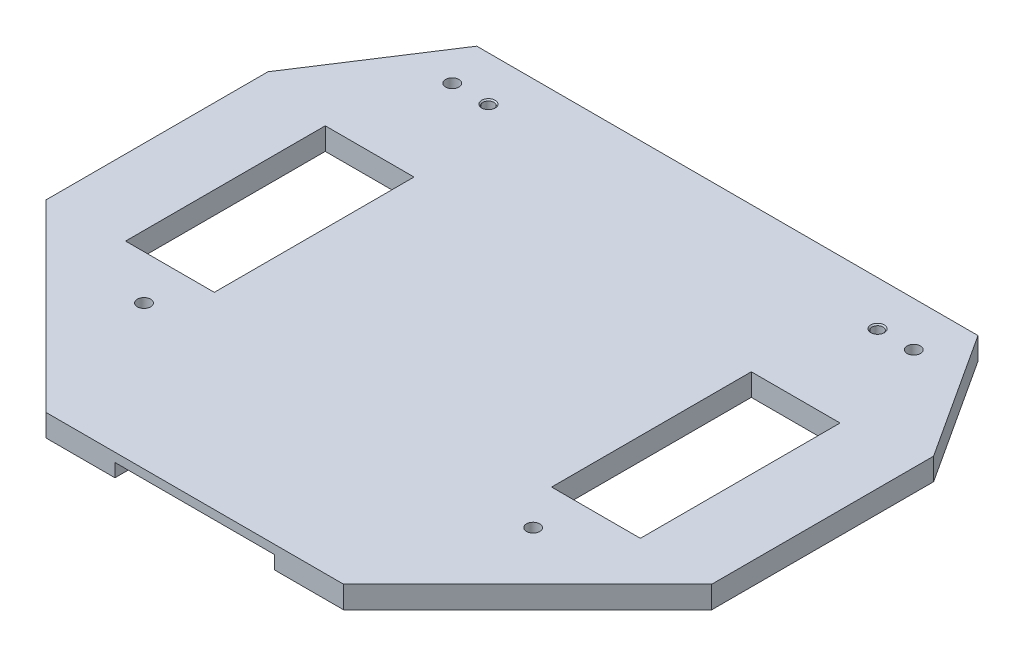
ISO-10303-21;
HEADER;
FILE_DESCRIPTION(('STEP AP214'),'2;1');
FILE_NAME('part.step','',(''),(''),'','','');
FILE_SCHEMA(('AUTOMOTIVE_DESIGN { 1 0 10303 214 1 1 1 1 }'));
ENDSEC;
DATA;
#1=APPLICATION_CONTEXT('core data for automotive mechanical design processes');
#2=APPLICATION_PROTOCOL_DEFINITION('international standard','automotive_design',2000,#1);
#3=PRODUCT_CONTEXT('',#1,'mechanical');
#4=PRODUCT('Part','Part','',(#3));
#5=PRODUCT_RELATED_PRODUCT_CATEGORY('part','',(#4));
#6=PRODUCT_DEFINITION_FORMATION('','',#4);
#7=PRODUCT_DEFINITION_CONTEXT('part definition',#1,'design');
#8=PRODUCT_DEFINITION('design','',#6,#7);
#9=PRODUCT_DEFINITION_SHAPE('','',#8);
#10=(LENGTH_UNIT() NAMED_UNIT(*) SI_UNIT(.MILLI.,.METRE.));
#11=(NAMED_UNIT(*) PLANE_ANGLE_UNIT() SI_UNIT($,.RADIAN.));
#12=(NAMED_UNIT(*) SI_UNIT($,.STERADIAN.) SOLID_ANGLE_UNIT());
#13=UNCERTAINTY_MEASURE_WITH_UNIT(LENGTH_MEASURE(1.E-05),#10,'distance_accuracy_value','');
#14=(GEOMETRIC_REPRESENTATION_CONTEXT(3) GLOBAL_UNCERTAINTY_ASSIGNED_CONTEXT((#13)) GLOBAL_UNIT_ASSIGNED_CONTEXT((#10,
#11,#12)) REPRESENTATION_CONTEXT('',''));
#15=CARTESIAN_POINT('',(0.,0.,0.));
#16=DIRECTION('',(0.,0.,1.));
#17=DIRECTION('',(1.,0.,0.));
#18=AXIS2_PLACEMENT_3D('',#15,#16,#17);
#19=CARTESIAN_POINT('',(0.,-45.,0.));
#20=DIRECTION('',(0.,1.,0.));
#21=DIRECTION('',(0.,0.,1.));
#22=AXIS2_PLACEMENT_3D('',#19,#20,#21);
#23=PLANE('',#22);
#24=CARTESIAN_POINT('',(-8.15695477905016,-45.,0.));
#25=DIRECTION('',(0.,1.,0.));
#26=DIRECTION('',(0.,0.,1.));
#27=AXIS2_PLACEMENT_3D('',#24,#25,#26);
#28=CIRCLE('',#27,1.25);
#29=CARTESIAN_POINT('',(-8.15695477905016,-45.,1.25));
#30=VERTEX_POINT('',#29);
#31=EDGE_CURVE('E717',#30,#30,#28,.T.);
#32=ORIENTED_EDGE('',*,*,#31,.T.);
#33=EDGE_LOOP('',(#32));
#34=FACE_BOUND('',#33,.T.);
#35=CARTESIAN_POINT('',(-95.8381956461826,-45.,0.));
#36=DIRECTION('',(0.,1.,0.));
#37=DIRECTION('',(0.,0.,1.));
#38=AXIS2_PLACEMENT_3D('',#35,#36,#37);
#39=CIRCLE('',#38,1.25);
#40=CARTESIAN_POINT('',(-95.8381956461826,-45.,1.25));
#41=VERTEX_POINT('',#40);
#42=EDGE_CURVE('E193',#41,#41,#39,.T.);
#43=ORIENTED_EDGE('',*,*,#42,.T.);
#44=EDGE_LOOP('',(#43));
#45=FACE_BOUND('',#44,.T.);
#46=DIRECTION('',(-1.,0.,0.));
#47=VECTOR('',#46,1.);
#48=CARTESIAN_POINT('',(-18.4685790284582,-45.,110.));
#49=LINE('',#48,#47);
#50=CARTESIAN_POINT('',(-18.4685790284582,-45.,110.));
#51=VERTEX_POINT('',#50);
#52=CARTESIAN_POINT('',(-34.,-45.,110.));
#53=VERTEX_POINT('',#52);
#54=EDGE_CURVE('E296',#51,#53,#49,.T.);
#55=ORIENTED_EDGE('',*,*,#54,.T.);
#56=DIRECTION('',(0.,0.,1.));
#57=VECTOR('',#56,1.);
#58=CARTESIAN_POINT('',(-34.,-45.,-7.));
#59=LINE('',#58,#57);
#60=CARTESIAN_POINT('',(-34.,-45.,-7.));
#61=VERTEX_POINT('',#60);
#62=EDGE_CURVE('E234',#61,#53,#59,.T.);
#63=ORIENTED_EDGE('',*,*,#62,.F.);
#64=DIRECTION('',(1.,0.,0.));
#65=VECTOR('',#64,1.);
#66=CARTESIAN_POINT('',(-34.,-45.,-7.));
#67=LINE('',#66,#65);
#68=CARTESIAN_POINT('',(-70.,-45.,-7.));
#69=VERTEX_POINT('',#68);
#70=EDGE_CURVE('E245',#69,#61,#67,.T.);
#71=ORIENTED_EDGE('',*,*,#70,.F.);
#72=DIRECTION('',(0.,0.,1.));
#73=VECTOR('',#72,1.);
#74=CARTESIAN_POINT('',(-70.,-45.,0.));
#75=LINE('',#74,#73);
#76=CARTESIAN_POINT('',(-70.,-45.,110.));
#77=VERTEX_POINT('',#76);
#78=EDGE_CURVE('E43',#69,#77,#75,.T.);
#79=ORIENTED_EDGE('',*,*,#78,.T.);
#80=CARTESIAN_POINT('',(-85.5326618386743,-45.,110.));
#81=VERTEX_POINT('',#80);
#82=EDGE_CURVE('E295',#77,#81,#49,.T.);
#83=ORIENTED_EDGE('',*,*,#82,.T.);
#84=DIRECTION('',(-0.707106781186544,0.,-0.707106781186551));
#85=VECTOR('',#84,1.);
#86=CARTESIAN_POINT('',(-127.,-45.,68.532661838674));
#87=LINE('',#86,#85);
#88=CARTESIAN_POINT('',(-127.,-45.,68.532661838674));
#89=VERTEX_POINT('',#88);
#90=EDGE_CURVE('E299',#81,#89,#87,.T.);
#91=ORIENTED_EDGE('',*,*,#90,.T.);
#92=DIRECTION('',(0.,0.,-1.));
#93=VECTOR('',#92,1.);
#94=CARTESIAN_POINT('',(-127.,-45.,68.532661838674));
#95=LINE('',#94,#93);
#96=CARTESIAN_POINT('',(-127.,-45.,18.529510203719));
#97=VERTEX_POINT('',#96);
#98=EDGE_CURVE('E301',#89,#97,#95,.T.);
#99=ORIENTED_EDGE('',*,*,#98,.T.);
#100=DIRECTION('',(0.544639035015021,0.,-0.838670567945428));
#101=VECTOR('',#100,1.);
#102=CARTESIAN_POINT('',(-108.472719443499,-45.,-10.));
#103=LINE('',#102,#101);
#104=CARTESIAN_POINT('',(-108.472719443499,-45.,-10.));
#105=VERTEX_POINT('',#104);
#106=EDGE_CURVE('E283',#97,#105,#103,.T.);
#107=ORIENTED_EDGE('',*,*,#106,.T.);
#108=DIRECTION('',(1.,0.,0.));
#109=VECTOR('',#108,1.);
#110=CARTESIAN_POINT('',(4.47147857636689,-45.,-10.));
#111=LINE('',#110,#109);
#112=CARTESIAN_POINT('',(4.47147857636689,-45.,-10.));
#113=VERTEX_POINT('',#112);
#114=EDGE_CURVE('E286',#105,#113,#111,.T.);
#115=ORIENTED_EDGE('',*,*,#114,.T.);
#116=DIRECTION('',(0.544639035015022,0.,0.838670567945427));
#117=VECTOR('',#116,1.);
#118=CARTESIAN_POINT('',(4.47147857636689,-45.,-10.));
#119=LINE('',#118,#117);
#120=CARTESIAN_POINT('',(23.,-45.,18.5314209715409));
#121=VERTEX_POINT('',#120);
#122=EDGE_CURVE('E289',#113,#121,#119,.T.);
#123=ORIENTED_EDGE('',*,*,#122,.T.);
#124=DIRECTION('',(0.,0.,1.));
#125=VECTOR('',#124,1.);
#126=CARTESIAN_POINT('',(23.0000000000001,-45.,68.5314209715411));
#127=LINE('',#126,#125);
#128=CARTESIAN_POINT('',(23.0000000000001,-45.,68.5314209715411));
#129=VERTEX_POINT('',#128);
#130=EDGE_CURVE('E291',#121,#129,#127,.T.);
#131=ORIENTED_EDGE('',*,*,#130,.T.);
#132=DIRECTION('',(-0.707106781186543,0.,0.707106781186552));
#133=VECTOR('',#132,1.);
#134=CARTESIAN_POINT('',(-18.4685790284582,-45.,110.));
#135=LINE('',#134,#133);
#136=EDGE_CURVE('E293',#129,#51,#135,.T.);
#137=ORIENTED_EDGE('',*,*,#136,.T.);
#138=EDGE_LOOP('',(#55,#63,#71,#79,#83,#91,#99,#107,#115,#123,#131,#137));
#139=FACE_BOUND('',#138,.T.);
#140=CARTESIAN_POINT('',(6.52256026967279E-13,-45.,-2.22044604925031E-13));
#141=DIRECTION('',(0.,-1.,0.));
#142=DIRECTION('',(0.,0.,-1.));
#143=AXIS2_PLACEMENT_3D('',#140,#141,#142);
#144=CIRCLE('',#143,1.49999999999999);
#145=CARTESIAN_POINT('',(6.52256026967279E-13,-45.,-1.50000000000021));
#146=VERTEX_POINT('',#145);
#147=EDGE_CURVE('E276',#146,#146,#144,.T.);
#148=ORIENTED_EDGE('',*,*,#147,.F.);
#149=EDGE_LOOP('',(#148));
#150=FACE_BOUND('',#149,.T.);
#151=CARTESIAN_POINT('',(-103.995150425233,-45.,0.));
#152=DIRECTION('',(0.,-1.,0.));
#153=DIRECTION('',(0.,0.,-1.));
#154=AXIS2_PLACEMENT_3D('',#151,#152,#153);
#155=CIRCLE('',#154,1.49999999999999);
#156=CARTESIAN_POINT('',(-103.995150425233,-45.,-1.50000000000004));
#157=VERTEX_POINT('',#156);
#158=EDGE_CURVE('E272',#157,#157,#155,.T.);
#159=ORIENTED_EDGE('',*,*,#158,.F.);
#160=EDGE_LOOP('',(#159));
#161=FACE_BOUND('',#160,.T.);
#162=CARTESIAN_POINT('',(-95.8381956461827,-45.,77.6082406044971));
#163=DIRECTION('',(0.,-1.,0.));
#164=DIRECTION('',(0.,0.,-1.));
#165=AXIS2_PLACEMENT_3D('',#162,#163,#164);
#166=CIRCLE('',#165,1.49999999999999);
#167=CARTESIAN_POINT('',(-95.8381956461827,-45.,76.1082406044971));
#168=VERTEX_POINT('',#167);
#169=EDGE_CURVE('E268',#168,#168,#166,.T.);
#170=ORIENTED_EDGE('',*,*,#169,.F.);
#171=EDGE_LOOP('',(#170));
#172=FACE_BOUND('',#171,.T.);
#173=CARTESIAN_POINT('',(-8.15695477905028,-45.,77.6082406044971));
#174=DIRECTION('',(0.,-1.,0.));
#175=DIRECTION('',(0.,0.,-1.));
#176=AXIS2_PLACEMENT_3D('',#173,#174,#175);
#177=CIRCLE('',#176,1.49999999999999);
#178=CARTESIAN_POINT('',(-8.15695477905028,-45.,76.1082406044971));
#179=VERTEX_POINT('',#178);
#180=EDGE_CURVE('E264',#179,#179,#177,.T.);
#181=ORIENTED_EDGE('',*,*,#180,.F.);
#182=EDGE_LOOP('',(#181));
#183=FACE_BOUND('',#182,.T.);
#184=DIRECTION('',(-1.,0.,0.));
#185=VECTOR('',#184,1.);
#186=CARTESIAN_POINT('',(5.99999999999999,-45.,67.6082406044971));
#187=LINE('',#186,#185);
#188=CARTESIAN_POINT('',(5.99999999999999,-45.,67.6082406044971));
#189=VERTEX_POINT('',#188);
#190=CARTESIAN_POINT('',(-14.,-45.,67.6082406044971));
#191=VERTEX_POINT('',#190);
#192=EDGE_CURVE('E224',#189,#191,#187,.T.);
#193=ORIENTED_EDGE('',*,*,#192,.F.);
#194=DIRECTION('',(0.,0.,1.));
#195=VECTOR('',#194,1.);
#196=CARTESIAN_POINT('',(6.,-45.,22.6082406044971));
#197=LINE('',#196,#195);
#198=CARTESIAN_POINT('',(6.,-45.,22.6082406044971));
#199=VERTEX_POINT('',#198);
#200=EDGE_CURVE('E205',#199,#189,#197,.T.);
#201=ORIENTED_EDGE('',*,*,#200,.F.);
#202=DIRECTION('',(1.,0.,0.));
#203=VECTOR('',#202,1.);
#204=CARTESIAN_POINT('',(6.,-45.,22.6082406044971));
#205=LINE('',#204,#203);
#206=CARTESIAN_POINT('',(-14.,-45.,22.6082406044971));
#207=VERTEX_POINT('',#206);
#208=EDGE_CURVE('E213',#207,#199,#205,.T.);
#209=ORIENTED_EDGE('',*,*,#208,.F.);
#210=DIRECTION('',(0.,0.,-1.));
#211=VECTOR('',#210,1.);
#212=CARTESIAN_POINT('',(-14.,-45.,22.6082406044971));
#213=LINE('',#212,#211);
#214=EDGE_CURVE('E227',#191,#207,#213,.T.);
#215=ORIENTED_EDGE('',*,*,#214,.F.);
#216=EDGE_LOOP('',(#193,#201,#209,#215));
#217=FACE_BOUND('',#216,.T.);
#218=DIRECTION('',(0.,0.,1.));
#219=VECTOR('',#218,1.);
#220=CARTESIAN_POINT('',(-110.,-45.,22.6082406044971));
#221=LINE('',#220,#219);
#222=CARTESIAN_POINT('',(-110.,-45.,22.6082406044971));
#223=VERTEX_POINT('',#222);
#224=CARTESIAN_POINT('',(-110.,-45.,67.6082406044971));
#225=VERTEX_POINT('',#224);
#226=EDGE_CURVE('E50',#223,#225,#221,.T.);
#227=ORIENTED_EDGE('',*,*,#226,.T.);
#228=DIRECTION('',(1.,0.,0.));
#229=VECTOR('',#228,1.);
#230=CARTESIAN_POINT('',(-110.,-45.,67.6082406044971));
#231=LINE('',#230,#229);
#232=CARTESIAN_POINT('',(-90.0000000000001,-45.,67.6082406044971));
#233=VERTEX_POINT('',#232);
#234=EDGE_CURVE('E187',#225,#233,#231,.T.);
#235=ORIENTED_EDGE('',*,*,#234,.T.);
#236=DIRECTION('',(0.,0.,-1.));
#237=VECTOR('',#236,1.);
#238=CARTESIAN_POINT('',(-90.0000000000001,-45.,22.6082406044971));
#239=LINE('',#238,#237);
#240=CARTESIAN_POINT('',(-90.0000000000001,-45.,22.6082406044971));
#241=VERTEX_POINT('',#240);
#242=EDGE_CURVE('E190',#233,#241,#239,.T.);
#243=ORIENTED_EDGE('',*,*,#242,.T.);
#244=DIRECTION('',(-1.,0.,0.));
#245=VECTOR('',#244,1.);
#246=CARTESIAN_POINT('',(-110.,-45.,22.6082406044971));
#247=LINE('',#246,#245);
#248=EDGE_CURVE('E199',#241,#223,#247,.T.);
#249=ORIENTED_EDGE('',*,*,#248,.T.);
#250=EDGE_LOOP('',(#227,#235,#243,#249));
#251=FACE_BOUND('',#250,.T.);
#252=ADVANCED_FACE('F35',(#34,#45,#139,#150,#161,#172,#183,#217,#251),#23,.F.);
#253=CARTESIAN_POINT('',(0.,-40.,0.));
#254=DIRECTION('',(0.,1.,0.));
#255=DIRECTION('',(0.,0.,1.));
#256=AXIS2_PLACEMENT_3D('',#253,#254,#255);
#257=PLANE('',#256);
#258=CARTESIAN_POINT('',(-8.15695477905016,-40.,0.));
#259=DIRECTION('',(0.,1.,0.));
#260=DIRECTION('',(0.,0.,1.));
#261=AXIS2_PLACEMENT_3D('',#258,#259,#260);
#262=CIRCLE('',#261,1.525);
#263=CARTESIAN_POINT('',(-8.15695477905016,-40.,1.525));
#264=VERTEX_POINT('',#263);
#265=EDGE_CURVE('E715',#264,#264,#262,.T.);
#266=ORIENTED_EDGE('',*,*,#265,.F.);
#267=EDGE_LOOP('',(#266));
#268=FACE_BOUND('',#267,.T.);
#269=CARTESIAN_POINT('',(-95.8381956461826,-40.,0.));
#270=DIRECTION('',(0.,1.,0.));
#271=DIRECTION('',(0.,0.,1.));
#272=AXIS2_PLACEMENT_3D('',#269,#270,#271);
#273=CIRCLE('',#272,1.525);
#274=CARTESIAN_POINT('',(-95.8381956461826,-40.,1.525));
#275=VERTEX_POINT('',#274);
#276=EDGE_CURVE('E721',#275,#275,#273,.T.);
#277=ORIENTED_EDGE('',*,*,#276,.F.);
#278=EDGE_LOOP('',(#277));
#279=FACE_BOUND('',#278,.T.);
#280=DIRECTION('',(0.544639035015021,0.,-0.838670567945428));
#281=VECTOR('',#280,1.);
#282=CARTESIAN_POINT('',(-108.472719443499,-40.,-10.));
#283=LINE('',#282,#281);
#284=CARTESIAN_POINT('',(-127.,-40.,18.529510203719));
#285=VERTEX_POINT('',#284);
#286=CARTESIAN_POINT('',(-108.472719443499,-40.,-10.));
#287=VERTEX_POINT('',#286);
#288=EDGE_CURVE('E282',#285,#287,#283,.T.);
#289=ORIENTED_EDGE('',*,*,#288,.F.);
#290=DIRECTION('',(0.,0.,-1.));
#291=VECTOR('',#290,1.);
#292=CARTESIAN_POINT('',(-127.,-40.,68.532661838674));
#293=LINE('',#292,#291);
#294=CARTESIAN_POINT('',(-127.,-40.,68.532661838674));
#295=VERTEX_POINT('',#294);
#296=EDGE_CURVE('E287',#295,#285,#293,.T.);
#297=ORIENTED_EDGE('',*,*,#296,.F.);
#298=DIRECTION('',(-0.707106781186544,0.,-0.707106781186551));
#299=VECTOR('',#298,1.);
#300=CARTESIAN_POINT('',(-127.,-40.,68.532661838674));
#301=LINE('',#300,#299);
#302=CARTESIAN_POINT('',(-85.5326618386743,-40.,110.));
#303=VERTEX_POINT('',#302);
#304=EDGE_CURVE('E316',#303,#295,#301,.T.);
#305=ORIENTED_EDGE('',*,*,#304,.F.);
#306=DIRECTION('',(-1.,0.,0.));
#307=VECTOR('',#306,1.);
#308=CARTESIAN_POINT('',(-18.4685790284582,-40.,110.));
#309=LINE('',#308,#307);
#310=CARTESIAN_POINT('',(-18.4685790284582,-40.,110.));
#311=VERTEX_POINT('',#310);
#312=EDGE_CURVE('E314',#311,#303,#309,.T.);
#313=ORIENTED_EDGE('',*,*,#312,.F.);
#314=DIRECTION('',(-0.707106781186543,0.,0.707106781186552));
#315=VECTOR('',#314,1.);
#316=CARTESIAN_POINT('',(-18.4685790284582,-40.,110.));
#317=LINE('',#316,#315);
#318=CARTESIAN_POINT('',(23.0000000000001,-40.,68.5314209715411));
#319=VERTEX_POINT('',#318);
#320=EDGE_CURVE('E312',#319,#311,#317,.T.);
#321=ORIENTED_EDGE('',*,*,#320,.F.);
#322=DIRECTION('',(0.,0.,1.));
#323=VECTOR('',#322,1.);
#324=CARTESIAN_POINT('',(23.0000000000001,-40.,68.5314209715411));
#325=LINE('',#324,#323);
#326=CARTESIAN_POINT('',(23.,-40.,18.5314209715409));
#327=VERTEX_POINT('',#326);
#328=EDGE_CURVE('E310',#327,#319,#325,.T.);
#329=ORIENTED_EDGE('',*,*,#328,.F.);
#330=DIRECTION('',(0.544639035015022,0.,0.838670567945427));
#331=VECTOR('',#330,1.);
#332=CARTESIAN_POINT('',(4.47147857636689,-40.,-10.));
#333=LINE('',#332,#331);
#334=CARTESIAN_POINT('',(4.47147857636689,-40.,-10.));
#335=VERTEX_POINT('',#334);
#336=EDGE_CURVE('E308',#335,#327,#333,.T.);
#337=ORIENTED_EDGE('',*,*,#336,.F.);
#338=DIRECTION('',(1.,0.,0.));
#339=VECTOR('',#338,1.);
#340=CARTESIAN_POINT('',(4.47147857636689,-40.,-10.));
#341=LINE('',#340,#339);
#342=EDGE_CURVE('E306',#287,#335,#341,.T.);
#343=ORIENTED_EDGE('',*,*,#342,.F.);
#344=EDGE_LOOP('',(#289,#297,#305,#313,#321,#329,#337,#343));
#345=FACE_BOUND('',#344,.T.);
#346=CARTESIAN_POINT('',(6.52256026967279E-13,-40.,-2.22044604925031E-13));
#347=DIRECTION('',(0.,1.,0.));
#348=DIRECTION('',(0.,0.,1.));
#349=AXIS2_PLACEMENT_3D('',#346,#347,#348);
#350=CIRCLE('',#349,1.49999999999999);
#351=CARTESIAN_POINT('',(6.52256026967279E-13,-40.,1.49999999999977));
#352=VERTEX_POINT('',#351);
#353=EDGE_CURVE('E279',#352,#352,#350,.T.);
#354=ORIENTED_EDGE('',*,*,#353,.F.);
#355=EDGE_LOOP('',(#354));
#356=FACE_BOUND('',#355,.T.);
#357=CARTESIAN_POINT('',(-103.995150425233,-40.,0.));
#358=DIRECTION('',(0.,1.,0.));
#359=DIRECTION('',(0.,0.,1.));
#360=AXIS2_PLACEMENT_3D('',#357,#358,#359);
#361=CIRCLE('',#360,1.49999999999999);
#362=CARTESIAN_POINT('',(-103.995150425233,-40.,1.49999999999994));
#363=VERTEX_POINT('',#362);
#364=EDGE_CURVE('E275',#363,#363,#361,.T.);
#365=ORIENTED_EDGE('',*,*,#364,.F.);
#366=EDGE_LOOP('',(#365));
#367=FACE_BOUND('',#366,.T.);
#368=CARTESIAN_POINT('',(-95.8381956461827,-40.,77.6082406044971));
#369=DIRECTION('',(0.,1.,0.));
#370=DIRECTION('',(0.,0.,1.));
#371=AXIS2_PLACEMENT_3D('',#368,#369,#370);
#372=CIRCLE('',#371,1.49999999999999);
#373=CARTESIAN_POINT('',(-95.8381956461827,-40.,79.1082406044971));
#374=VERTEX_POINT('',#373);
#375=EDGE_CURVE('E271',#374,#374,#372,.T.);
#376=ORIENTED_EDGE('',*,*,#375,.F.);
#377=EDGE_LOOP('',(#376));
#378=FACE_BOUND('',#377,.T.);
#379=CARTESIAN_POINT('',(-8.15695477905028,-40.,77.6082406044971));
#380=DIRECTION('',(0.,1.,0.));
#381=DIRECTION('',(0.,0.,1.));
#382=AXIS2_PLACEMENT_3D('',#379,#380,#381);
#383=CIRCLE('',#382,1.49999999999999);
#384=CARTESIAN_POINT('',(-8.15695477905028,-40.,79.1082406044971));
#385=VERTEX_POINT('',#384);
#386=EDGE_CURVE('E267',#385,#385,#383,.T.);
#387=ORIENTED_EDGE('',*,*,#386,.F.);
#388=EDGE_LOOP('',(#387));
#389=FACE_BOUND('',#388,.T.);
#390=DIRECTION('',(0.,0.,1.));
#391=VECTOR('',#390,1.);
#392=CARTESIAN_POINT('',(6.,-40.,22.6082406044971));
#393=LINE('',#392,#391);
#394=CARTESIAN_POINT('',(6.,-40.,22.6082406044971));
#395=VERTEX_POINT('',#394);
#396=CARTESIAN_POINT('',(5.99999999999999,-40.,67.6082406044971));
#397=VERTEX_POINT('',#396);
#398=EDGE_CURVE('E209',#395,#397,#393,.T.);
#399=ORIENTED_EDGE('',*,*,#398,.T.);
#400=DIRECTION('',(-1.,0.,0.));
#401=VECTOR('',#400,1.);
#402=CARTESIAN_POINT('',(5.99999999999999,-40.,67.6082406044971));
#403=LINE('',#402,#401);
#404=CARTESIAN_POINT('',(-14.,-40.,67.6082406044971));
#405=VERTEX_POINT('',#404);
#406=EDGE_CURVE('E212',#397,#405,#403,.T.);
#407=ORIENTED_EDGE('',*,*,#406,.T.);
#408=DIRECTION('',(0.,0.,-1.));
#409=VECTOR('',#408,1.);
#410=CARTESIAN_POINT('',(-14.,-40.,22.6082406044971));
#411=LINE('',#410,#409);
#412=CARTESIAN_POINT('',(-14.,-40.,22.6082406044971));
#413=VERTEX_POINT('',#412);
#414=EDGE_CURVE('E216',#405,#413,#411,.T.);
#415=ORIENTED_EDGE('',*,*,#414,.T.);
#416=DIRECTION('',(1.,0.,0.));
#417=VECTOR('',#416,1.);
#418=CARTESIAN_POINT('',(6.,-40.,22.6082406044971));
#419=LINE('',#418,#417);
#420=EDGE_CURVE('E219',#413,#395,#419,.T.);
#421=ORIENTED_EDGE('',*,*,#420,.T.);
#422=EDGE_LOOP('',(#399,#407,#415,#421));
#423=FACE_BOUND('',#422,.T.);
#424=DIRECTION('',(1.,0.,0.));
#425=VECTOR('',#424,1.);
#426=CARTESIAN_POINT('',(-110.,-40.,67.6082406044971));
#427=LINE('',#426,#425);
#428=CARTESIAN_POINT('',(-110.,-40.,67.6082406044971));
#429=VERTEX_POINT('',#428);
#430=CARTESIAN_POINT('',(-90.0000000000001,-40.,67.6082406044971));
#431=VERTEX_POINT('',#430);
#432=EDGE_CURVE('E183',#429,#431,#427,.T.);
#433=ORIENTED_EDGE('',*,*,#432,.F.);
#434=DIRECTION('',(0.,0.,1.));
#435=VECTOR('',#434,1.);
#436=CARTESIAN_POINT('',(-110.,-40.,22.6082406044971));
#437=LINE('',#436,#435);
#438=CARTESIAN_POINT('',(-110.,-40.,22.6082406044971));
#439=VERTEX_POINT('',#438);
#440=EDGE_CURVE('E179',#439,#429,#437,.T.);
#441=ORIENTED_EDGE('',*,*,#440,.F.);
#442=DIRECTION('',(-1.,0.,0.));
#443=VECTOR('',#442,1.);
#444=CARTESIAN_POINT('',(-110.,-40.,22.6082406044971));
#445=LINE('',#444,#443);
#446=CARTESIAN_POINT('',(-90.0000000000001,-40.,22.6082406044971));
#447=VERTEX_POINT('',#446);
#448=EDGE_CURVE('E171',#447,#439,#445,.T.);
#449=ORIENTED_EDGE('',*,*,#448,.F.);
#450=DIRECTION('',(0.,0.,-1.));
#451=VECTOR('',#450,1.);
#452=CARTESIAN_POINT('',(-90.0000000000001,-40.,22.6082406044971));
#453=LINE('',#452,#451);
#454=EDGE_CURVE('E178',#431,#447,#453,.T.);
#455=ORIENTED_EDGE('',*,*,#454,.F.);
#456=EDGE_LOOP('',(#433,#441,#449,#455));
#457=FACE_BOUND('',#456,.T.);
#458=ADVANCED_FACE('F186',(#268,#279,#345,#356,#367,#378,#389,#423,#457),#257,.T.);
#459=CARTESIAN_POINT('',(-108.472719443499,-45.,-10.));
#460=DIRECTION('',(0.838670567945428,0.,0.544639035015021));
#461=DIRECTION('',(0.544639035015021,0.,-0.838670567945428));
#462=AXIS2_PLACEMENT_3D('',#459,#460,#461);
#463=PLANE('',#462);
#464=ORIENTED_EDGE('',*,*,#288,.T.);
#465=DIRECTION('',(0.,1.,0.));
#466=VECTOR('',#465,1.);
#467=CARTESIAN_POINT('',(-108.472719443499,-45.,-10.));
#468=LINE('',#467,#466);
#469=EDGE_CURVE('E339',#105,#287,#468,.T.);
#470=ORIENTED_EDGE('',*,*,#469,.F.);
#471=ORIENTED_EDGE('',*,*,#106,.F.);
#472=DIRECTION('',(0.,1.,0.));
#473=VECTOR('',#472,1.);
#474=CARTESIAN_POINT('',(-127.,-45.,18.529510203719));
#475=LINE('',#474,#473);
#476=EDGE_CURVE('E303',#97,#285,#475,.T.);
#477=ORIENTED_EDGE('',*,*,#476,.T.);
#478=EDGE_LOOP('',(#464,#470,#471,#477));
#479=FACE_BOUND('',#478,.T.);
#480=ADVANCED_FACE('F37',(#479),#463,.F.);
#481=CARTESIAN_POINT('',(4.47147857636689,-45.,-10.));
#482=DIRECTION('',(0.,0.,1.));
#483=DIRECTION('',(1.,0.,0.));
#484=AXIS2_PLACEMENT_3D('',#481,#482,#483);
#485=PLANE('',#484);
#486=ORIENTED_EDGE('',*,*,#342,.T.);
#487=DIRECTION('',(0.,1.,0.));
#488=VECTOR('',#487,1.);
#489=CARTESIAN_POINT('',(4.47147857636689,-45.,-10.));
#490=LINE('',#489,#488);
#491=EDGE_CURVE('E336',#113,#335,#490,.T.);
#492=ORIENTED_EDGE('',*,*,#491,.F.);
#493=ORIENTED_EDGE('',*,*,#114,.F.);
#494=ORIENTED_EDGE('',*,*,#469,.T.);
#495=EDGE_LOOP('',(#486,#492,#493,#494));
#496=FACE_BOUND('',#495,.T.);
#497=ADVANCED_FACE('F375',(#496),#485,.F.);
#498=CARTESIAN_POINT('',(4.47147857636689,-45.,-10.));
#499=DIRECTION('',(-0.838670567945427,0.,0.544639035015022));
#500=DIRECTION('',(0.544639035015022,0.,0.838670567945427));
#501=AXIS2_PLACEMENT_3D('',#498,#499,#500);
#502=PLANE('',#501);
#503=ORIENTED_EDGE('',*,*,#336,.T.);
#504=DIRECTION('',(0.,1.,0.));
#505=VECTOR('',#504,1.);
#506=CARTESIAN_POINT('',(23.,-45.,18.5314209715409));
#507=LINE('',#506,#505);
#508=EDGE_CURVE('E333',#121,#327,#507,.T.);
#509=ORIENTED_EDGE('',*,*,#508,.F.);
#510=ORIENTED_EDGE('',*,*,#122,.F.);
#511=ORIENTED_EDGE('',*,*,#491,.T.);
#512=EDGE_LOOP('',(#503,#509,#510,#511));
#513=FACE_BOUND('',#512,.T.);
#514=ADVANCED_FACE('F382',(#513),#502,.F.);
#515=CARTESIAN_POINT('',(23.0000000000001,-45.,68.5314209715411));
#516=DIRECTION('',(-1.,0.,0.));
#517=DIRECTION('',(0.,0.,1.));
#518=AXIS2_PLACEMENT_3D('',#515,#516,#517);
#519=PLANE('',#518);
#520=ORIENTED_EDGE('',*,*,#328,.T.);
#521=DIRECTION('',(0.,1.,0.));
#522=VECTOR('',#521,1.);
#523=CARTESIAN_POINT('',(23.0000000000001,-45.,68.5314209715411));
#524=LINE('',#523,#522);
#525=EDGE_CURVE('E330',#129,#319,#524,.T.);
#526=ORIENTED_EDGE('',*,*,#525,.F.);
#527=ORIENTED_EDGE('',*,*,#130,.F.);
#528=ORIENTED_EDGE('',*,*,#508,.T.);
#529=EDGE_LOOP('',(#520,#526,#527,#528));
#530=FACE_BOUND('',#529,.T.);
#531=ADVANCED_FACE('F386',(#530),#519,.F.);
#532=CARTESIAN_POINT('',(-18.4685790284582,-45.,110.));
#533=DIRECTION('',(-0.707106781186552,0.,-0.707106781186543));
#534=DIRECTION('',(-0.707106781186543,0.,0.707106781186552));
#535=AXIS2_PLACEMENT_3D('',#532,#533,#534);
#536=PLANE('',#535);
#537=ORIENTED_EDGE('',*,*,#320,.T.);
#538=DIRECTION('',(0.,1.,0.));
#539=VECTOR('',#538,1.);
#540=CARTESIAN_POINT('',(-18.4685790284582,-45.,110.));
#541=LINE('',#540,#539);
#542=EDGE_CURVE('E327',#51,#311,#541,.T.);
#543=ORIENTED_EDGE('',*,*,#542,.F.);
#544=ORIENTED_EDGE('',*,*,#136,.F.);
#545=ORIENTED_EDGE('',*,*,#525,.T.);
#546=EDGE_LOOP('',(#537,#543,#544,#545));
#547=FACE_BOUND('',#546,.T.);
#548=ADVANCED_FACE('F391',(#547),#536,.F.);
#549=CARTESIAN_POINT('',(-18.4685790284582,-45.,110.));
#550=DIRECTION('',(0.,0.,-1.));
#551=DIRECTION('',(-1.,0.,0.));
#552=AXIS2_PLACEMENT_3D('',#549,#550,#551);
#553=PLANE('',#552);
#554=DIRECTION('',(-1.,0.,0.));
#555=VECTOR('',#554,1.);
#556=CARTESIAN_POINT('',(-18.4685790284582,-42.,110.));
#557=LINE('',#556,#555);
#558=CARTESIAN_POINT('',(-34.,-42.,110.));
#559=VERTEX_POINT('',#558);
#560=CARTESIAN_POINT('',(-70.,-42.,110.));
#561=VERTEX_POINT('',#560);
#562=EDGE_CURVE('E11',#559,#561,#557,.T.);
#563=ORIENTED_EDGE('',*,*,#562,.F.);
#564=DIRECTION('',(0.,-1.,0.));
#565=VECTOR('',#564,1.);
#566=CARTESIAN_POINT('',(-34.,-45.,110.));
#567=LINE('',#566,#565);
#568=EDGE_CURVE('E261',#559,#53,#567,.T.);
#569=ORIENTED_EDGE('',*,*,#568,.T.);
#570=ORIENTED_EDGE('',*,*,#54,.F.);
#571=ORIENTED_EDGE('',*,*,#542,.T.);
#572=ORIENTED_EDGE('',*,*,#312,.T.);
#573=DIRECTION('',(0.,1.,0.));
#574=VECTOR('',#573,1.);
#575=CARTESIAN_POINT('',(-85.5326618386743,-45.,110.));
#576=LINE('',#575,#574);
#577=EDGE_CURVE('E324',#81,#303,#576,.T.);
#578=ORIENTED_EDGE('',*,*,#577,.F.);
#579=ORIENTED_EDGE('',*,*,#82,.F.);
#580=DIRECTION('',(0.,1.,0.));
#581=VECTOR('',#580,1.);
#582=CARTESIAN_POINT('',(-70.,-45.,110.));
#583=LINE('',#582,#581);
#584=EDGE_CURVE('E256',#77,#561,#583,.T.);
#585=ORIENTED_EDGE('',*,*,#584,.T.);
#586=EDGE_LOOP('',(#563,#569,#570,#571,#572,#578,#579,#585));
#587=FACE_BOUND('',#586,.T.);
#588=ADVANCED_FACE('F358',(#587),#553,.F.);
#589=CARTESIAN_POINT('',(-127.,-45.,68.532661838674));
#590=DIRECTION('',(0.707106781186551,0.,-0.707106781186544));
#591=DIRECTION('',(-0.707106781186544,0.,-0.707106781186551));
#592=AXIS2_PLACEMENT_3D('',#589,#590,#591);
#593=PLANE('',#592);
#594=ORIENTED_EDGE('',*,*,#304,.T.);
#595=DIRECTION('',(0.,1.,0.));
#596=VECTOR('',#595,1.);
#597=CARTESIAN_POINT('',(-127.,-45.,68.532661838674));
#598=LINE('',#597,#596);
#599=EDGE_CURVE('E321',#89,#295,#598,.T.);
#600=ORIENTED_EDGE('',*,*,#599,.F.);
#601=ORIENTED_EDGE('',*,*,#90,.F.);
#602=ORIENTED_EDGE('',*,*,#577,.T.);
#603=EDGE_LOOP('',(#594,#600,#601,#602));
#604=FACE_BOUND('',#603,.T.);
#605=ADVANCED_FACE('F364',(#604),#593,.F.);
#606=CARTESIAN_POINT('',(-127.,-45.,68.532661838674));
#607=DIRECTION('',(1.,0.,0.));
#608=DIRECTION('',(0.,0.,-1.));
#609=AXIS2_PLACEMENT_3D('',#606,#607,#608);
#610=PLANE('',#609);
#611=ORIENTED_EDGE('',*,*,#296,.T.);
#612=ORIENTED_EDGE('',*,*,#476,.F.);
#613=ORIENTED_EDGE('',*,*,#98,.F.);
#614=ORIENTED_EDGE('',*,*,#599,.T.);
#615=EDGE_LOOP('',(#611,#612,#613,#614));
#616=FACE_BOUND('',#615,.T.);
#617=ADVANCED_FACE('F370',(#616),#610,.F.);
#618=CARTESIAN_POINT('',(6.52256026967279E-13,-45.,-2.22044604925031E-13));
#619=DIRECTION('',(0.,-1.,0.));
#620=DIRECTION('',(0.,0.,-1.));
#621=AXIS2_PLACEMENT_3D('',#618,#619,#620);
#622=CYLINDRICAL_SURFACE('',#621,1.49999999999999);
#623=ORIENTED_EDGE('',*,*,#353,.T.);
#624=EDGE_LOOP('',(#623));
#625=FACE_BOUND('',#624,.T.);
#626=ORIENTED_EDGE('',*,*,#147,.T.);
#627=EDGE_LOOP('',(#626));
#628=FACE_BOUND('',#627,.T.);
#629=ADVANCED_FACE('F423',(#625,#628),#622,.F.);
#630=CARTESIAN_POINT('',(-103.995150425233,-45.,0.));
#631=DIRECTION('',(0.,-1.,0.));
#632=DIRECTION('',(0.,0.,-1.));
#633=AXIS2_PLACEMENT_3D('',#630,#631,#632);
#634=CYLINDRICAL_SURFACE('',#633,1.49999999999999);
#635=ORIENTED_EDGE('',*,*,#364,.T.);
#636=EDGE_LOOP('',(#635));
#637=FACE_BOUND('',#636,.T.);
#638=ORIENTED_EDGE('',*,*,#158,.T.);
#639=EDGE_LOOP('',(#638));
#640=FACE_BOUND('',#639,.T.);
#641=ADVANCED_FACE('F540',(#637,#640),#634,.F.);
#642=CARTESIAN_POINT('',(-95.8381956461827,-45.,77.6082406044971));
#643=DIRECTION('',(0.,-1.,0.));
#644=DIRECTION('',(0.,0.,-1.));
#645=AXIS2_PLACEMENT_3D('',#642,#643,#644);
#646=CYLINDRICAL_SURFACE('',#645,1.49999999999999);
#647=ORIENTED_EDGE('',*,*,#375,.T.);
#648=EDGE_LOOP('',(#647));
#649=FACE_BOUND('',#648,.T.);
#650=ORIENTED_EDGE('',*,*,#169,.T.);
#651=EDGE_LOOP('',(#650));
#652=FACE_BOUND('',#651,.T.);
#653=ADVANCED_FACE('F534',(#649,#652),#646,.F.);
#654=CARTESIAN_POINT('',(-8.15695477905028,-45.,77.6082406044971));
#655=DIRECTION('',(0.,-1.,0.));
#656=DIRECTION('',(0.,0.,-1.));
#657=AXIS2_PLACEMENT_3D('',#654,#655,#656);
#658=CYLINDRICAL_SURFACE('',#657,1.49999999999999);
#659=ORIENTED_EDGE('',*,*,#386,.T.);
#660=EDGE_LOOP('',(#659));
#661=FACE_BOUND('',#660,.T.);
#662=ORIENTED_EDGE('',*,*,#180,.T.);
#663=EDGE_LOOP('',(#662));
#664=FACE_BOUND('',#663,.T.);
#665=ADVANCED_FACE('F530',(#661,#664),#658,.F.);
#666=CARTESIAN_POINT('',(0.,-42.,0.));
#667=DIRECTION('',(0.,-1.,0.));
#668=DIRECTION('',(0.,0.,-1.));
#669=AXIS2_PLACEMENT_3D('',#666,#667,#668);
#670=PLANE('',#669);
#671=ORIENTED_EDGE('',*,*,#562,.T.);
#672=DIRECTION('',(0.,0.,-1.));
#673=VECTOR('',#672,1.);
#674=CARTESIAN_POINT('',(-70.,-42.,-7.));
#675=LINE('',#674,#673);
#676=CARTESIAN_POINT('',(-70.,-42.,-7.));
#677=VERTEX_POINT('',#676);
#678=EDGE_CURVE('E244',#561,#677,#675,.T.);
#679=ORIENTED_EDGE('',*,*,#678,.T.);
#680=DIRECTION('',(1.,0.,0.));
#681=VECTOR('',#680,1.);
#682=CARTESIAN_POINT('',(-34.,-42.,-7.));
#683=LINE('',#682,#681);
#684=CARTESIAN_POINT('',(-34.,-42.,-7.));
#685=VERTEX_POINT('',#684);
#686=EDGE_CURVE('E247',#677,#685,#683,.T.);
#687=ORIENTED_EDGE('',*,*,#686,.T.);
#688=DIRECTION('',(0.,0.,1.));
#689=VECTOR('',#688,1.);
#690=CARTESIAN_POINT('',(-34.,-42.,-7.));
#691=LINE('',#690,#689);
#692=EDGE_CURVE('E241',#685,#559,#691,.T.);
#693=ORIENTED_EDGE('',*,*,#692,.T.);
#694=EDGE_LOOP('',(#671,#679,#687,#693));
#695=FACE_BOUND('',#694,.T.);
#696=ADVANCED_FACE('F397',(#695),#670,.T.);
#697=CARTESIAN_POINT('',(-34.,-42.,-7.));
#698=DIRECTION('',(1.,0.,0.));
#699=DIRECTION('',(0.,0.,-1.));
#700=AXIS2_PLACEMENT_3D('',#697,#698,#699);
#701=PLANE('',#700);
#702=ORIENTED_EDGE('',*,*,#692,.F.);
#703=DIRECTION('',(0.,-1.,0.));
#704=VECTOR('',#703,1.);
#705=CARTESIAN_POINT('',(-34.,-42.,-7.));
#706=LINE('',#705,#704);
#707=EDGE_CURVE('E254',#685,#61,#706,.T.);
#708=ORIENTED_EDGE('',*,*,#707,.T.);
#709=ORIENTED_EDGE('',*,*,#62,.T.);
#710=ORIENTED_EDGE('',*,*,#568,.F.);
#711=EDGE_LOOP('',(#702,#708,#709,#710));
#712=FACE_BOUND('',#711,.T.);
#713=ADVANCED_FACE('F395',(#712),#701,.F.);
#714=CARTESIAN_POINT('',(-70.,-42.,-7.));
#715=DIRECTION('',(-1.,0.,0.));
#716=DIRECTION('',(0.,0.,1.));
#717=AXIS2_PLACEMENT_3D('',#714,#715,#716);
#718=PLANE('',#717);
#719=ORIENTED_EDGE('',*,*,#78,.F.);
#720=DIRECTION('',(0.,-1.,0.));
#721=VECTOR('',#720,1.);
#722=CARTESIAN_POINT('',(-70.,-42.,-7.));
#723=LINE('',#722,#721);
#724=EDGE_CURVE('E250',#677,#69,#723,.T.);
#725=ORIENTED_EDGE('',*,*,#724,.F.);
#726=ORIENTED_EDGE('',*,*,#678,.F.);
#727=ORIENTED_EDGE('',*,*,#584,.F.);
#728=EDGE_LOOP('',(#719,#725,#726,#727));
#729=FACE_BOUND('',#728,.T.);
#730=ADVANCED_FACE('F402',(#729),#718,.F.);
#731=CARTESIAN_POINT('',(-34.,-42.,-7.));
#732=DIRECTION('',(0.,0.,-1.));
#733=DIRECTION('',(-1.,0.,0.));
#734=AXIS2_PLACEMENT_3D('',#731,#732,#733);
#735=PLANE('',#734);
#736=ORIENTED_EDGE('',*,*,#70,.T.);
#737=ORIENTED_EDGE('',*,*,#707,.F.);
#738=ORIENTED_EDGE('',*,*,#686,.F.);
#739=ORIENTED_EDGE('',*,*,#724,.T.);
#740=EDGE_LOOP('',(#736,#737,#738,#739));
#741=FACE_BOUND('',#740,.T.);
#742=ADVANCED_FACE('F401',(#741),#735,.F.);
#743=CARTESIAN_POINT('',(6.,-40.,22.6082406044971));
#744=DIRECTION('',(1.,0.,0.));
#745=DIRECTION('',(0.,0.,-1.));
#746=AXIS2_PLACEMENT_3D('',#743,#744,#745);
#747=PLANE('',#746);
#748=ORIENTED_EDGE('',*,*,#200,.T.);
#749=DIRECTION('',(0.,-1.,0.));
#750=VECTOR('',#749,1.);
#751=CARTESIAN_POINT('',(5.99999999999999,-40.,67.6082406044971));
#752=LINE('',#751,#750);
#753=EDGE_CURVE('E222',#397,#189,#752,.T.);
#754=ORIENTED_EDGE('',*,*,#753,.F.);
#755=ORIENTED_EDGE('',*,*,#398,.F.);
#756=DIRECTION('',(0.,-1.,0.));
#757=VECTOR('',#756,1.);
#758=CARTESIAN_POINT('',(6.,-40.,22.6082406044971));
#759=LINE('',#758,#757);
#760=EDGE_CURVE('E232',#395,#199,#759,.T.);
#761=ORIENTED_EDGE('',*,*,#760,.T.);
#762=EDGE_LOOP('',(#748,#754,#755,#761));
#763=FACE_BOUND('',#762,.T.);
#764=ADVANCED_FACE('F409',(#763),#747,.F.);
#765=CARTESIAN_POINT('',(6.,-40.,22.6082406044971));
#766=DIRECTION('',(0.,0.,-1.));
#767=DIRECTION('',(-1.,0.,0.));
#768=AXIS2_PLACEMENT_3D('',#765,#766,#767);
#769=PLANE('',#768);
#770=ORIENTED_EDGE('',*,*,#208,.T.);
#771=ORIENTED_EDGE('',*,*,#760,.F.);
#772=ORIENTED_EDGE('',*,*,#420,.F.);
#773=DIRECTION('',(0.,-1.,0.));
#774=VECTOR('',#773,1.);
#775=CARTESIAN_POINT('',(-14.,-40.,22.6082406044971));
#776=LINE('',#775,#774);
#777=EDGE_CURVE('E235',#413,#207,#776,.T.);
#778=ORIENTED_EDGE('',*,*,#777,.T.);
#779=EDGE_LOOP('',(#770,#771,#772,#778));
#780=FACE_BOUND('',#779,.T.);
#781=ADVANCED_FACE('F515',(#780),#769,.F.);
#782=CARTESIAN_POINT('',(-14.,-40.,22.6082406044971));
#783=DIRECTION('',(-1.,0.,0.));
#784=DIRECTION('',(0.,0.,1.));
#785=AXIS2_PLACEMENT_3D('',#782,#783,#784);
#786=PLANE('',#785);
#787=ORIENTED_EDGE('',*,*,#214,.T.);
#788=ORIENTED_EDGE('',*,*,#777,.F.);
#789=ORIENTED_EDGE('',*,*,#414,.F.);
#790=DIRECTION('',(0.,-1.,0.));
#791=VECTOR('',#790,1.);
#792=CARTESIAN_POINT('',(-14.,-40.,67.6082406044971));
#793=LINE('',#792,#791);
#794=EDGE_CURVE('E237',#405,#191,#793,.T.);
#795=ORIENTED_EDGE('',*,*,#794,.T.);
#796=EDGE_LOOP('',(#787,#788,#789,#795));
#797=FACE_BOUND('',#796,.T.);
#798=ADVANCED_FACE('F518',(#797),#786,.F.);
#799=CARTESIAN_POINT('',(5.99999999999999,-40.,67.6082406044971));
#800=DIRECTION('',(0.,0.,1.));
#801=DIRECTION('',(1.,0.,0.));
#802=AXIS2_PLACEMENT_3D('',#799,#800,#801);
#803=PLANE('',#802);
#804=ORIENTED_EDGE('',*,*,#192,.T.);
#805=ORIENTED_EDGE('',*,*,#794,.F.);
#806=ORIENTED_EDGE('',*,*,#406,.F.);
#807=ORIENTED_EDGE('',*,*,#753,.T.);
#808=EDGE_LOOP('',(#804,#805,#806,#807));
#809=FACE_BOUND('',#808,.T.);
#810=ADVANCED_FACE('F514',(#809),#803,.F.);
#811=CARTESIAN_POINT('',(-110.,-40.,22.6082406044971));
#812=DIRECTION('',(1.,0.,0.));
#813=DIRECTION('',(0.,0.,-1.));
#814=AXIS2_PLACEMENT_3D('',#811,#812,#813);
#815=PLANE('',#814);
#816=ORIENTED_EDGE('',*,*,#226,.F.);
#817=DIRECTION('',(0.,-1.,0.));
#818=VECTOR('',#817,1.);
#819=CARTESIAN_POINT('',(-110.,-40.,22.6082406044971));
#820=LINE('',#819,#818);
#821=EDGE_CURVE('E173',#439,#223,#820,.T.);
#822=ORIENTED_EDGE('',*,*,#821,.F.);
#823=ORIENTED_EDGE('',*,*,#440,.T.);
#824=DIRECTION('',(0.,-1.,0.));
#825=VECTOR('',#824,1.);
#826=CARTESIAN_POINT('',(-110.,-40.,67.6082406044971));
#827=LINE('',#826,#825);
#828=EDGE_CURVE('E203',#429,#225,#827,.T.);
#829=ORIENTED_EDGE('',*,*,#828,.T.);
#830=EDGE_LOOP('',(#816,#822,#823,#829));
#831=FACE_BOUND('',#830,.T.);
#832=ADVANCED_FACE('F181',(#831),#815,.T.);
#833=CARTESIAN_POINT('',(-110.,-40.,67.6082406044971));
#834=DIRECTION('',(0.,0.,-1.));
#835=DIRECTION('',(-1.,0.,0.));
#836=AXIS2_PLACEMENT_3D('',#833,#834,#835);
#837=PLANE('',#836);
#838=ORIENTED_EDGE('',*,*,#234,.F.);
#839=ORIENTED_EDGE('',*,*,#828,.F.);
#840=ORIENTED_EDGE('',*,*,#432,.T.);
#841=DIRECTION('',(0.,-1.,0.));
#842=VECTOR('',#841,1.);
#843=CARTESIAN_POINT('',(-90.0000000000001,-40.,67.6082406044971));
#844=LINE('',#843,#842);
#845=EDGE_CURVE('E206',#431,#233,#844,.T.);
#846=ORIENTED_EDGE('',*,*,#845,.T.);
#847=EDGE_LOOP('',(#838,#839,#840,#846));
#848=FACE_BOUND('',#847,.T.);
#849=ADVANCED_FACE('F502',(#848),#837,.T.);
#850=CARTESIAN_POINT('',(-90.0000000000001,-40.,22.6082406044971));
#851=DIRECTION('',(-1.,0.,0.));
#852=DIRECTION('',(0.,0.,1.));
#853=AXIS2_PLACEMENT_3D('',#850,#851,#852);
#854=PLANE('',#853);
#855=ORIENTED_EDGE('',*,*,#242,.F.);
#856=ORIENTED_EDGE('',*,*,#845,.F.);
#857=ORIENTED_EDGE('',*,*,#454,.T.);
#858=DIRECTION('',(0.,-1.,0.));
#859=VECTOR('',#858,1.);
#860=CARTESIAN_POINT('',(-90.0000000000001,-40.,22.6082406044971));
#861=LINE('',#860,#859);
#862=EDGE_CURVE('E58',#447,#241,#861,.T.);
#863=ORIENTED_EDGE('',*,*,#862,.T.);
#864=EDGE_LOOP('',(#855,#856,#857,#863));
#865=FACE_BOUND('',#864,.T.);
#866=ADVANCED_FACE('F505',(#865),#854,.T.);
#867=CARTESIAN_POINT('',(-110.,-40.,22.6082406044971));
#868=DIRECTION('',(0.,0.,1.));
#869=DIRECTION('',(1.,0.,0.));
#870=AXIS2_PLACEMENT_3D('',#867,#868,#869);
#871=PLANE('',#870);
#872=ORIENTED_EDGE('',*,*,#248,.F.);
#873=ORIENTED_EDGE('',*,*,#862,.F.);
#874=ORIENTED_EDGE('',*,*,#448,.T.);
#875=ORIENTED_EDGE('',*,*,#821,.T.);
#876=EDGE_LOOP('',(#872,#873,#874,#875));
#877=FACE_BOUND('',#876,.T.);
#878=ADVANCED_FACE('F172',(#877),#871,.T.);
#879=CARTESIAN_POINT('',(-95.8381956461826,-40.,0.));
#880=DIRECTION('',(0.,1.,0.));
#881=DIRECTION('',(0.,0.,1.));
#882=AXIS2_PLACEMENT_3D('',#879,#880,#881);
#883=CYLINDRICAL_SURFACE('',#882,1.25);
#884=ORIENTED_EDGE('',*,*,#42,.F.);
#885=EDGE_LOOP('',(#884));
#886=FACE_BOUND('',#885,.T.);
#887=CARTESIAN_POINT('',(-95.8381956461826,-40.275,0.));
#888=DIRECTION('',(0.,1.,0.));
#889=DIRECTION('',(0.,0.,1.));
#890=AXIS2_PLACEMENT_3D('',#887,#888,#889);
#891=CIRCLE('',#890,1.25);
#892=CARTESIAN_POINT('',(-95.8381956461826,-40.275,1.25));
#893=VERTEX_POINT('',#892);
#894=EDGE_CURVE('E723',#893,#893,#891,.T.);
#895=ORIENTED_EDGE('',*,*,#894,.T.);
#896=EDGE_LOOP('',(#895));
#897=FACE_BOUND('',#896,.T.);
#898=ADVANCED_FACE('F456',(#886,#897),#883,.F.);
#899=CARTESIAN_POINT('',(-95.8381956461826,-40.,0.));
#900=DIRECTION('',(0.,1.,0.));
#901=DIRECTION('',(0.,0.,1.));
#902=AXIS2_PLACEMENT_3D('',#899,#900,#901);
#903=CONICAL_SURFACE('',#902,1.525,0.785398163397448);
#904=ORIENTED_EDGE('',*,*,#894,.F.);
#905=EDGE_LOOP('',(#904));
#906=FACE_BOUND('',#905,.T.);
#907=ORIENTED_EDGE('',*,*,#276,.T.);
#908=EDGE_LOOP('',(#907));
#909=FACE_BOUND('',#908,.T.);
#910=ADVANCED_FACE('F462',(#906,#909),#903,.F.);
#911=CARTESIAN_POINT('',(-8.15695477905016,-40.,0.));
#912=DIRECTION('',(0.,1.,0.));
#913=DIRECTION('',(0.,0.,1.));
#914=AXIS2_PLACEMENT_3D('',#911,#912,#913);
#915=CYLINDRICAL_SURFACE('',#914,1.25);
#916=ORIENTED_EDGE('',*,*,#31,.F.);
#917=EDGE_LOOP('',(#916));
#918=FACE_BOUND('',#917,.T.);
#919=CARTESIAN_POINT('',(-8.15695477905016,-40.275,0.));
#920=DIRECTION('',(0.,1.,0.));
#921=DIRECTION('',(0.,0.,1.));
#922=AXIS2_PLACEMENT_3D('',#919,#920,#921);
#923=CIRCLE('',#922,1.25);
#924=CARTESIAN_POINT('',(-8.15695477905016,-40.275,1.25));
#925=VERTEX_POINT('',#924);
#926=EDGE_CURVE('E712',#925,#925,#923,.T.);
#927=ORIENTED_EDGE('',*,*,#926,.T.);
#928=EDGE_LOOP('',(#927));
#929=FACE_BOUND('',#928,.T.);
#930=ADVANCED_FACE('F474',(#918,#929),#915,.F.);
#931=CARTESIAN_POINT('',(-8.15695477905016,-40.,0.));
#932=DIRECTION('',(0.,1.,0.));
#933=DIRECTION('',(0.,0.,1.));
#934=AXIS2_PLACEMENT_3D('',#931,#932,#933);
#935=CONICAL_SURFACE('',#934,1.525,0.785398163397455);
#936=ORIENTED_EDGE('',*,*,#926,.F.);
#937=EDGE_LOOP('',(#936));
#938=FACE_BOUND('',#937,.T.);
#939=ORIENTED_EDGE('',*,*,#265,.T.);
#940=EDGE_LOOP('',(#939));
#941=FACE_BOUND('',#940,.T.);
#942=ADVANCED_FACE('F484',(#938,#941),#935,.F.);
#943=CLOSED_SHELL('',(#252,#458,#480,#497,#514,#531,#548,#588,#605,#617,#629,#641,#653,#665,
#696,#713,#730,#742,#764,#781,#798,#810,#832,#849,#866,#878,#898,#910,#930,#942));
#944=MANIFOLD_SOLID_BREP('B2',#943);
#945=ADVANCED_BREP_SHAPE_REPRESENTATION('',(#18,#944),#14);
#946=SHAPE_DEFINITION_REPRESENTATION(#9,#945);
ENDSEC;
END-ISO-10303-21;
